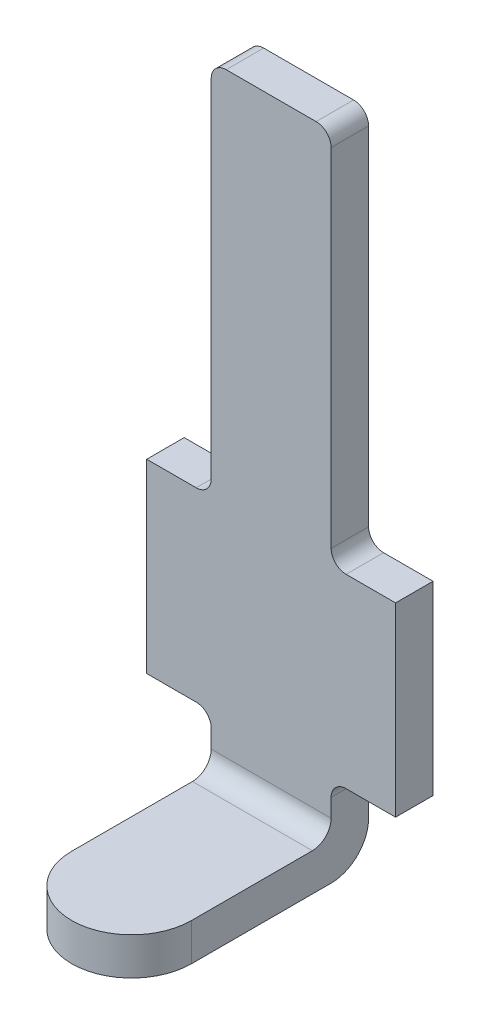
ISO-10303-21;
HEADER;
FILE_DESCRIPTION(('STEP AP214'),'2;1');
FILE_NAME('part.step','',(''),(''),'','','');
FILE_SCHEMA(('AUTOMOTIVE_DESIGN { 1 0 10303 214 1 1 1 1 }'));
ENDSEC;
DATA;
#1=APPLICATION_CONTEXT('core data for automotive mechanical design processes');
#2=APPLICATION_PROTOCOL_DEFINITION('international standard','automotive_design',2000,#1);
#3=PRODUCT_CONTEXT('',#1,'mechanical');
#4=PRODUCT('Part','Part','',(#3));
#5=PRODUCT_RELATED_PRODUCT_CATEGORY('part','',(#4));
#6=PRODUCT_DEFINITION_FORMATION('','',#4);
#7=PRODUCT_DEFINITION_CONTEXT('part definition',#1,'design');
#8=PRODUCT_DEFINITION('design','',#6,#7);
#9=PRODUCT_DEFINITION_SHAPE('','',#8);
#10=(LENGTH_UNIT() NAMED_UNIT(*) SI_UNIT(.MILLI.,.METRE.));
#11=(NAMED_UNIT(*) PLANE_ANGLE_UNIT() SI_UNIT($,.RADIAN.));
#12=(NAMED_UNIT(*) SI_UNIT($,.STERADIAN.) SOLID_ANGLE_UNIT());
#13=UNCERTAINTY_MEASURE_WITH_UNIT(LENGTH_MEASURE(1.E-05),#10,'distance_accuracy_value','');
#14=(GEOMETRIC_REPRESENTATION_CONTEXT(3) GLOBAL_UNCERTAINTY_ASSIGNED_CONTEXT((#13)) GLOBAL_UNIT_ASSIGNED_CONTEXT((#10,
#11,#12)) REPRESENTATION_CONTEXT('',''));
#15=CARTESIAN_POINT('',(0.,0.,0.));
#16=DIRECTION('',(0.,0.,1.));
#17=DIRECTION('',(1.,0.,0.));
#18=AXIS2_PLACEMENT_3D('',#15,#16,#17);
#19=CARTESIAN_POINT('',(-1.77,0.0459658151929143,0.749000000000012));
#20=DIRECTION('',(0.,0.,-1.));
#21=DIRECTION('',(-1.,0.,0.));
#22=AXIS2_PLACEMENT_3D('',#19,#20,#21);
#23=CYLINDRICAL_SURFACE('',#22,0.1);
#24=CARTESIAN_POINT('',(-1.77,0.0459658151929143,0.498999999999983));
#25=DIRECTION('',(0.,0.,1.));
#26=DIRECTION('',(1.,0.,0.));
#27=AXIS2_PLACEMENT_3D('',#24,#25,#26);
#28=CIRCLE('',#27,0.1);
#29=CARTESIAN_POINT('',(-1.67,0.0459658151929143,0.498999999999983));
#30=VERTEX_POINT('',#29);
#31=CARTESIAN_POINT('',(-1.77,0.145965815192914,0.499000000000012));
#32=VERTEX_POINT('',#31);
#33=EDGE_CURVE('E312',#30,#32,#28,.T.);
#34=ORIENTED_EDGE('',*,*,#33,.F.);
#35=DIRECTION('',(0.,0.,-1.));
#36=VECTOR('',#35,1.);
#37=CARTESIAN_POINT('',(-1.67,0.0459658151929143,0.499000000000012));
#38=LINE('',#37,#36);
#39=CARTESIAN_POINT('',(-1.67,0.0459658151929143,0.748999999999983));
#40=VERTEX_POINT('',#39);
#41=EDGE_CURVE('E331',#40,#30,#38,.T.);
#42=ORIENTED_EDGE('',*,*,#41,.F.);
#43=CARTESIAN_POINT('',(-1.77,0.0459658151929143,0.748999999999983));
#44=DIRECTION('',(0.,0.,-1.));
#45=DIRECTION('',(-1.,0.,0.));
#46=AXIS2_PLACEMENT_3D('',#43,#44,#45);
#47=CIRCLE('',#46,0.1);
#48=CARTESIAN_POINT('',(-1.77,0.145965815192914,0.749000000000012));
#49=VERTEX_POINT('',#48);
#50=EDGE_CURVE('E317',#49,#40,#47,.T.);
#51=ORIENTED_EDGE('',*,*,#50,.F.);
#52=DIRECTION('',(0.,0.,1.));
#53=VECTOR('',#52,1.);
#54=CARTESIAN_POINT('',(-1.77,0.145965815192914,0.748999999999983));
#55=LINE('',#54,#53);
#56=EDGE_CURVE('E411',#32,#49,#55,.T.);
#57=ORIENTED_EDGE('',*,*,#56,.F.);
#58=EDGE_LOOP('',(#34,#42,#51,#57));
#59=FACE_BOUND('',#58,.T.);
#60=ADVANCED_FACE('F16',(#59),#23,.F.);
#61=CARTESIAN_POINT('',(-0.77,0.0459658151929143,0.748999999999984));
#62=DIRECTION('',(0.,0.,1.));
#63=DIRECTION('',(1.,0.,0.));
#64=AXIS2_PLACEMENT_3D('',#61,#62,#63);
#65=CYLINDRICAL_SURFACE('',#64,0.1);
#66=CARTESIAN_POINT('',(-0.77,0.0459658151929143,0.498999999999984));
#67=DIRECTION('',(0.,0.,1.));
#68=DIRECTION('',(1.,0.,0.));
#69=AXIS2_PLACEMENT_3D('',#66,#67,#68);
#70=CIRCLE('',#69,0.1);
#71=CARTESIAN_POINT('',(-0.77,0.145965815192914,0.499000000000013));
#72=VERTEX_POINT('',#71);
#73=CARTESIAN_POINT('',(-0.87,0.0459658151929143,0.498999999999984));
#74=VERTEX_POINT('',#73);
#75=EDGE_CURVE('E292',#72,#74,#70,.T.);
#76=ORIENTED_EDGE('',*,*,#75,.F.);
#77=DIRECTION('',(0.,0.,-1.));
#78=VECTOR('',#77,1.);
#79=CARTESIAN_POINT('',(-0.77,0.145965815192914,0.749000000000013));
#80=LINE('',#79,#78);
#81=CARTESIAN_POINT('',(-0.77,0.145965815192914,0.749000000000013));
#82=VERTEX_POINT('',#81);
#83=EDGE_CURVE('E27',#82,#72,#80,.T.);
#84=ORIENTED_EDGE('',*,*,#83,.F.);
#85=CARTESIAN_POINT('',(-0.77,0.0459658151929143,0.748999999999984));
#86=DIRECTION('',(0.,0.,-1.));
#87=DIRECTION('',(-1.,0.,0.));
#88=AXIS2_PLACEMENT_3D('',#85,#86,#87);
#89=CIRCLE('',#88,0.1);
#90=CARTESIAN_POINT('',(-0.87,0.0459658151929143,0.748999999999984));
#91=VERTEX_POINT('',#90);
#92=EDGE_CURVE('E265',#91,#82,#89,.T.);
#93=ORIENTED_EDGE('',*,*,#92,.F.);
#94=DIRECTION('',(0.,0.,1.));
#95=VECTOR('',#94,1.);
#96=CARTESIAN_POINT('',(-0.87,0.0459658151929143,0.748999999999984));
#97=LINE('',#96,#95);
#98=EDGE_CURVE('E191',#74,#91,#97,.T.);
#99=ORIENTED_EDGE('',*,*,#98,.F.);
#100=EDGE_LOOP('',(#76,#84,#93,#99));
#101=FACE_BOUND('',#100,.T.);
#102=ADVANCED_FACE('F533',(#101),#65,.F.);
#103=CARTESIAN_POINT('',(-1.77,1.48437551370885,0.748999999999983));
#104=DIRECTION('',(0.,0.,1.));
#105=DIRECTION('',(1.,0.,0.));
#106=AXIS2_PLACEMENT_3D('',#103,#104,#105);
#107=CYLINDRICAL_SURFACE('',#106,0.1);
#108=CARTESIAN_POINT('',(-1.77,1.48437551370885,0.498999999999983));
#109=DIRECTION('',(0.,0.,1.));
#110=DIRECTION('',(1.,0.,0.));
#111=AXIS2_PLACEMENT_3D('',#108,#109,#110);
#112=CIRCLE('',#111,0.1);
#113=CARTESIAN_POINT('',(-1.77,1.38437551370885,0.499000000000012));
#114=VERTEX_POINT('',#113);
#115=CARTESIAN_POINT('',(-1.67,1.48437551370885,0.498999999999983));
#116=VERTEX_POINT('',#115);
#117=EDGE_CURVE('E79',#114,#116,#112,.T.);
#118=ORIENTED_EDGE('',*,*,#117,.F.);
#119=DIRECTION('',(0.,0.,-1.));
#120=VECTOR('',#119,1.);
#121=CARTESIAN_POINT('',(-1.77,1.38437551370885,0.749000000000012));
#122=LINE('',#121,#120);
#123=CARTESIAN_POINT('',(-1.77,1.38437551370885,0.749000000000012));
#124=VERTEX_POINT('',#123);
#125=EDGE_CURVE('E42',#124,#114,#122,.T.);
#126=ORIENTED_EDGE('',*,*,#125,.F.);
#127=CARTESIAN_POINT('',(-1.77,1.48437551370885,0.748999999999983));
#128=DIRECTION('',(0.,0.,-1.));
#129=DIRECTION('',(-1.,0.,0.));
#130=AXIS2_PLACEMENT_3D('',#127,#128,#129);
#131=CIRCLE('',#130,0.1);
#132=CARTESIAN_POINT('',(-1.67,1.48437551370885,0.748999999999983));
#133=VERTEX_POINT('',#132);
#134=EDGE_CURVE('E289',#133,#124,#131,.T.);
#135=ORIENTED_EDGE('',*,*,#134,.F.);
#136=DIRECTION('',(0.,0.,1.));
#137=VECTOR('',#136,1.);
#138=CARTESIAN_POINT('',(-1.67,1.48437551370885,0.748999999999983));
#139=LINE('',#138,#137);
#140=EDGE_CURVE('E321',#116,#133,#139,.T.);
#141=ORIENTED_EDGE('',*,*,#140,.F.);
#142=EDGE_LOOP('',(#118,#126,#135,#141));
#143=FACE_BOUND('',#142,.T.);
#144=ADVANCED_FACE('F535',(#143),#107,.F.);
#145=CARTESIAN_POINT('',(-0.77,1.48437551370885,0.749000000000014));
#146=DIRECTION('',(0.,0.,-1.));
#147=DIRECTION('',(-1.,0.,0.));
#148=AXIS2_PLACEMENT_3D('',#145,#146,#147);
#149=CYLINDRICAL_SURFACE('',#148,0.1);
#150=CARTESIAN_POINT('',(-0.77,1.48437551370885,0.498999999999985));
#151=DIRECTION('',(0.,0.,1.));
#152=DIRECTION('',(1.,0.,0.));
#153=AXIS2_PLACEMENT_3D('',#150,#151,#152);
#154=CIRCLE('',#153,0.1);
#155=CARTESIAN_POINT('',(-0.87,1.48437551370885,0.498999999999984));
#156=VERTEX_POINT('',#155);
#157=CARTESIAN_POINT('',(-0.77,1.38437551370885,0.499000000000013));
#158=VERTEX_POINT('',#157);
#159=EDGE_CURVE('E390',#156,#158,#154,.T.);
#160=ORIENTED_EDGE('',*,*,#159,.F.);
#161=DIRECTION('',(0.,0.,-1.));
#162=VECTOR('',#161,1.);
#163=CARTESIAN_POINT('',(-0.87,1.48437551370885,0.498999999999984));
#164=LINE('',#163,#162);
#165=CARTESIAN_POINT('',(-0.87,1.48437551370885,0.748999999999984));
#166=VERTEX_POINT('',#165);
#167=EDGE_CURVE('E20',#166,#156,#164,.T.);
#168=ORIENTED_EDGE('',*,*,#167,.F.);
#169=CARTESIAN_POINT('',(-0.77,1.48437551370885,0.748999999999984));
#170=DIRECTION('',(0.,0.,-1.));
#171=DIRECTION('',(-1.,0.,0.));
#172=AXIS2_PLACEMENT_3D('',#169,#170,#171);
#173=CIRCLE('',#172,0.1);
#174=CARTESIAN_POINT('',(-0.77,1.38437551370885,0.749000000000014));
#175=VERTEX_POINT('',#174);
#176=EDGE_CURVE('E337',#175,#166,#173,.T.);
#177=ORIENTED_EDGE('',*,*,#176,.F.);
#178=DIRECTION('',(0.,0.,1.));
#179=VECTOR('',#178,1.);
#180=CARTESIAN_POINT('',(-0.77,1.38437551370885,0.748999999999984));
#181=LINE('',#180,#179);
#182=EDGE_CURVE('E280',#158,#175,#181,.T.);
#183=ORIENTED_EDGE('',*,*,#182,.F.);
#184=EDGE_LOOP('',(#160,#168,#177,#183));
#185=FACE_BOUND('',#184,.T.);
#186=ADVANCED_FACE('F458',(#185),#149,.F.);
#187=CARTESIAN_POINT('',(-1.57,3.8,0.748999999999983));
#188=DIRECTION('',(0.,0.,-1.));
#189=DIRECTION('',(-1.,0.,0.));
#190=AXIS2_PLACEMENT_3D('',#187,#188,#189);
#191=CYLINDRICAL_SURFACE('',#190,0.1);
#192=CARTESIAN_POINT('',(-1.57,3.8,0.498999999999984));
#193=DIRECTION('',(0.,0.,-1.));
#194=DIRECTION('',(1.,0.,0.));
#195=AXIS2_PLACEMENT_3D('',#192,#193,#194);
#196=CIRCLE('',#195,0.1);
#197=CARTESIAN_POINT('',(-1.67,3.8,0.498999999999984));
#198=VERTEX_POINT('',#197);
#199=CARTESIAN_POINT('',(-1.57,3.9,0.498999999999984));
#200=VERTEX_POINT('',#199);
#201=EDGE_CURVE('E299',#198,#200,#196,.T.);
#202=ORIENTED_EDGE('',*,*,#201,.F.);
#203=DIRECTION('',(0.,0.,-1.));
#204=VECTOR('',#203,1.);
#205=CARTESIAN_POINT('',(-1.67,3.8,0.498999999999984));
#206=LINE('',#205,#204);
#207=CARTESIAN_POINT('',(-1.67,3.8,0.748999999999983));
#208=VERTEX_POINT('',#207);
#209=EDGE_CURVE('E285',#208,#198,#206,.T.);
#210=ORIENTED_EDGE('',*,*,#209,.F.);
#211=CARTESIAN_POINT('',(-1.57,3.8,0.748999999999983));
#212=DIRECTION('',(0.,0.,1.));
#213=DIRECTION('',(-1.,0.,0.));
#214=AXIS2_PLACEMENT_3D('',#211,#212,#213);
#215=CIRCLE('',#214,0.1);
#216=CARTESIAN_POINT('',(-1.57,3.9,0.748999999999983));
#217=VERTEX_POINT('',#216);
#218=EDGE_CURVE('E286',#217,#208,#215,.T.);
#219=ORIENTED_EDGE('',*,*,#218,.F.);
#220=DIRECTION('',(0.,0.,1.));
#221=VECTOR('',#220,1.);
#222=CARTESIAN_POINT('',(-1.57,3.9,0.748999999999983));
#223=LINE('',#222,#221);
#224=EDGE_CURVE('E412',#200,#217,#223,.T.);
#225=ORIENTED_EDGE('',*,*,#224,.F.);
#226=EDGE_LOOP('',(#202,#210,#219,#225));
#227=FACE_BOUND('',#226,.T.);
#228=ADVANCED_FACE('F552',(#227),#191,.T.);
#229=CARTESIAN_POINT('',(-0.97,3.8,0.748999999999984));
#230=DIRECTION('',(0.,0.,1.));
#231=DIRECTION('',(1.,0.,0.));
#232=AXIS2_PLACEMENT_3D('',#229,#230,#231);
#233=CYLINDRICAL_SURFACE('',#232,0.1);
#234=CARTESIAN_POINT('',(-0.97,3.8,0.498999999999985));
#235=DIRECTION('',(0.,0.,-1.));
#236=DIRECTION('',(1.,0.,0.));
#237=AXIS2_PLACEMENT_3D('',#234,#235,#236);
#238=CIRCLE('',#237,0.1);
#239=CARTESIAN_POINT('',(-0.97,3.9,0.498999999999985));
#240=VERTEX_POINT('',#239);
#241=CARTESIAN_POINT('',(-0.87,3.8,0.498999999999985));
#242=VERTEX_POINT('',#241);
#243=EDGE_CURVE('E387',#240,#242,#238,.T.);
#244=ORIENTED_EDGE('',*,*,#243,.F.);
#245=DIRECTION('',(0.,0.,-1.));
#246=VECTOR('',#245,1.);
#247=CARTESIAN_POINT('',(-0.97,3.9,0.748999999999984));
#248=LINE('',#247,#246);
#249=CARTESIAN_POINT('',(-0.97,3.9,0.748999999999984));
#250=VERTEX_POINT('',#249);
#251=EDGE_CURVE('E301',#250,#240,#248,.T.);
#252=ORIENTED_EDGE('',*,*,#251,.F.);
#253=CARTESIAN_POINT('',(-0.97,3.8,0.748999999999984));
#254=DIRECTION('',(0.,0.,1.));
#255=DIRECTION('',(-1.,0.,0.));
#256=AXIS2_PLACEMENT_3D('',#253,#254,#255);
#257=CIRCLE('',#256,0.1);
#258=CARTESIAN_POINT('',(-0.87,3.8,0.748999999999984));
#259=VERTEX_POINT('',#258);
#260=EDGE_CURVE('E62',#259,#250,#257,.T.);
#261=ORIENTED_EDGE('',*,*,#260,.F.);
#262=DIRECTION('',(0.,0.,1.));
#263=VECTOR('',#262,1.);
#264=CARTESIAN_POINT('',(-0.87,3.8,0.748999999999984));
#265=LINE('',#264,#263);
#266=EDGE_CURVE('E373',#242,#259,#265,.T.);
#267=ORIENTED_EDGE('',*,*,#266,.F.);
#268=EDGE_LOOP('',(#244,#252,#261,#267));
#269=FACE_BOUND('',#268,.T.);
#270=ADVANCED_FACE('F561',(#269),#233,.T.);
#271=CARTESIAN_POINT('',(-0.44,0.,1.00308650274883E-13));
#272=DIRECTION('',(-1.,0.,0.));
#273=DIRECTION('',(0.,0.,1.));
#274=AXIS2_PLACEMENT_3D('',#271,#272,#273);
#275=PLANE('',#274);
#276=DIRECTION('',(0.,0.,-1.));
#277=VECTOR('',#276,1.);
#278=CARTESIAN_POINT('',(-0.44,1.38437551370885,0.749000000000014));
#279=LINE('',#278,#277);
#280=CARTESIAN_POINT('',(-0.44,1.38437551370885,0.749000000000014));
#281=VERTEX_POINT('',#280);
#282=CARTESIAN_POINT('',(-0.44,1.38437551370885,0.499000000000014));
#283=VERTEX_POINT('',#282);
#284=EDGE_CURVE('E257',#281,#283,#279,.T.);
#285=ORIENTED_EDGE('',*,*,#284,.F.);
#286=DIRECTION('',(0.,-1.,0.));
#287=VECTOR('',#286,1.);
#288=CARTESIAN_POINT('',(-0.44,1.38437551370885,0.749000000000014));
#289=LINE('',#288,#287);
#290=CARTESIAN_POINT('',(-0.44,0.145965815192914,0.749000000000014));
#291=VERTEX_POINT('',#290);
#292=EDGE_CURVE('E255',#281,#291,#289,.T.);
#293=ORIENTED_EDGE('',*,*,#292,.T.);
#294=DIRECTION('',(0.,0.,-1.));
#295=VECTOR('',#294,1.);
#296=CARTESIAN_POINT('',(-0.44,0.145965815192914,0.749000000000014));
#297=LINE('',#296,#295);
#298=CARTESIAN_POINT('',(-0.44,0.145965815192914,0.499000000000014));
#299=VERTEX_POINT('',#298);
#300=EDGE_CURVE('E11',#291,#299,#297,.T.);
#301=ORIENTED_EDGE('',*,*,#300,.T.);
#302=DIRECTION('',(0.,-1.,0.));
#303=VECTOR('',#302,1.);
#304=CARTESIAN_POINT('',(-0.44,1.38437551370885,0.499000000000014));
#305=LINE('',#304,#303);
#306=EDGE_CURVE('E361',#283,#299,#305,.T.);
#307=ORIENTED_EDGE('',*,*,#306,.F.);
#308=EDGE_LOOP('',(#285,#293,#301,#307));
#309=FACE_BOUND('',#308,.T.);
#310=ADVANCED_FACE('F256',(#309),#275,.F.);
#311=CARTESIAN_POINT('',(-2.1,0.145965815192914,0.749000000000011));
#312=DIRECTION('',(0.,-1.,0.));
#313=DIRECTION('',(0.,0.,-1.));
#314=AXIS2_PLACEMENT_3D('',#311,#312,#313);
#315=PLANE('',#314);
#316=DIRECTION('',(1.,0.,0.));
#317=VECTOR('',#316,1.);
#318=CARTESIAN_POINT('',(-2.1,0.145965815192914,0.749000000000011));
#319=LINE('',#318,#317);
#320=EDGE_CURVE('E247',#82,#291,#319,.T.);
#321=ORIENTED_EDGE('',*,*,#320,.F.);
#322=ORIENTED_EDGE('',*,*,#83,.T.);
#323=DIRECTION('',(1.,0.,0.));
#324=VECTOR('',#323,1.);
#325=CARTESIAN_POINT('',(-2.1,0.145965815192914,0.499000000000011));
#326=LINE('',#325,#324);
#327=EDGE_CURVE('E250',#72,#299,#326,.T.);
#328=ORIENTED_EDGE('',*,*,#327,.T.);
#329=ORIENTED_EDGE('',*,*,#300,.F.);
#330=EDGE_LOOP('',(#321,#322,#328,#329));
#331=FACE_BOUND('',#330,.T.);
#332=ADVANCED_FACE('F245',(#331),#315,.T.);
#333=CARTESIAN_POINT('',(-2.1,1.38437551370885,0.749000000000012));
#334=DIRECTION('',(0.,-1.,0.));
#335=DIRECTION('',(0.,0.,-1.));
#336=AXIS2_PLACEMENT_3D('',#333,#334,#335);
#337=PLANE('',#336);
#338=DIRECTION('',(1.,0.,0.));
#339=VECTOR('',#338,1.);
#340=CARTESIAN_POINT('',(-2.1,1.38437551370885,0.499000000000011));
#341=LINE('',#340,#339);
#342=EDGE_CURVE('E399',#158,#283,#341,.T.);
#343=ORIENTED_EDGE('',*,*,#342,.F.);
#344=ORIENTED_EDGE('',*,*,#182,.T.);
#345=DIRECTION('',(1.,0.,0.));
#346=VECTOR('',#345,1.);
#347=CARTESIAN_POINT('',(-2.1,1.38437551370885,0.749000000000012));
#348=LINE('',#347,#346);
#349=EDGE_CURVE('E261',#175,#281,#348,.T.);
#350=ORIENTED_EDGE('',*,*,#349,.T.);
#351=ORIENTED_EDGE('',*,*,#284,.T.);
#352=EDGE_LOOP('',(#343,#344,#350,#351));
#353=FACE_BOUND('',#352,.T.);
#354=ADVANCED_FACE('F18',(#353),#337,.F.);
#355=CARTESIAN_POINT('',(-2.1,1.38437551370885,0.749000000000012));
#356=DIRECTION('',(0.,-1.,0.));
#357=DIRECTION('',(0.,0.,-1.));
#358=AXIS2_PLACEMENT_3D('',#355,#356,#357);
#359=PLANE('',#358);
#360=DIRECTION('',(1.,0.,0.));
#361=VECTOR('',#360,1.);
#362=CARTESIAN_POINT('',(-2.1,1.38437551370885,0.749000000000012));
#363=LINE('',#362,#361);
#364=CARTESIAN_POINT('',(-2.1,1.38437551370885,0.749000000000012));
#365=VERTEX_POINT('',#364);
#366=EDGE_CURVE('E338',#365,#124,#363,.T.);
#367=ORIENTED_EDGE('',*,*,#366,.T.);
#368=ORIENTED_EDGE('',*,*,#125,.T.);
#369=DIRECTION('',(1.,0.,0.));
#370=VECTOR('',#369,1.);
#371=CARTESIAN_POINT('',(-2.1,1.38437551370885,0.499000000000011));
#372=LINE('',#371,#370);
#373=CARTESIAN_POINT('',(-2.1,1.38437551370885,0.499000000000011));
#374=VERTEX_POINT('',#373);
#375=EDGE_CURVE('E300',#374,#114,#372,.T.);
#376=ORIENTED_EDGE('',*,*,#375,.F.);
#377=DIRECTION('',(0.,0.,-1.));
#378=VECTOR('',#377,1.);
#379=CARTESIAN_POINT('',(-2.1,1.38437551370885,0.749000000000012));
#380=LINE('',#379,#378);
#381=EDGE_CURVE('E341',#365,#374,#380,.T.);
#382=ORIENTED_EDGE('',*,*,#381,.F.);
#383=EDGE_LOOP('',(#367,#368,#376,#382));
#384=FACE_BOUND('',#383,.T.);
#385=ADVANCED_FACE('F555',(#384),#359,.F.);
#386=CARTESIAN_POINT('',(-2.1,0.145965815192914,0.749000000000011));
#387=DIRECTION('',(0.,-1.,0.));
#388=DIRECTION('',(0.,0.,-1.));
#389=AXIS2_PLACEMENT_3D('',#386,#387,#388);
#390=PLANE('',#389);
#391=DIRECTION('',(1.,0.,0.));
#392=VECTOR('',#391,1.);
#393=CARTESIAN_POINT('',(-2.1,0.145965815192914,0.499000000000011));
#394=LINE('',#393,#392);
#395=CARTESIAN_POINT('',(-2.1,0.145965815192914,0.499000000000011));
#396=VERTEX_POINT('',#395);
#397=EDGE_CURVE('E307',#396,#32,#394,.T.);
#398=ORIENTED_EDGE('',*,*,#397,.T.);
#399=ORIENTED_EDGE('',*,*,#56,.T.);
#400=DIRECTION('',(1.,0.,0.));
#401=VECTOR('',#400,1.);
#402=CARTESIAN_POINT('',(-2.1,0.145965815192914,0.749000000000011));
#403=LINE('',#402,#401);
#404=CARTESIAN_POINT('',(-2.1,0.145965815192914,0.749000000000011));
#405=VERTEX_POINT('',#404);
#406=EDGE_CURVE('E313',#405,#49,#403,.T.);
#407=ORIENTED_EDGE('',*,*,#406,.F.);
#408=DIRECTION('',(0.,0.,-1.));
#409=VECTOR('',#408,1.);
#410=CARTESIAN_POINT('',(-2.1,0.145965815192914,0.749000000000011));
#411=LINE('',#410,#409);
#412=EDGE_CURVE('E344',#405,#396,#411,.T.);
#413=ORIENTED_EDGE('',*,*,#412,.T.);
#414=EDGE_LOOP('',(#398,#399,#407,#413));
#415=FACE_BOUND('',#414,.T.);
#416=ADVANCED_FACE('F558',(#415),#390,.T.);
#417=CARTESIAN_POINT('',(-2.1,0.,0.));
#418=DIRECTION('',(-1.,0.,0.));
#419=DIRECTION('',(0.,0.,1.));
#420=AXIS2_PLACEMENT_3D('',#417,#418,#419);
#421=PLANE('',#420);
#422=ORIENTED_EDGE('',*,*,#381,.T.);
#423=DIRECTION('',(0.,-1.,0.));
#424=VECTOR('',#423,1.);
#425=CARTESIAN_POINT('',(-2.1,1.38437551370885,0.499000000000011));
#426=LINE('',#425,#424);
#427=EDGE_CURVE('E311',#374,#396,#426,.T.);
#428=ORIENTED_EDGE('',*,*,#427,.T.);
#429=ORIENTED_EDGE('',*,*,#412,.F.);
#430=DIRECTION('',(0.,-1.,0.));
#431=VECTOR('',#430,1.);
#432=CARTESIAN_POINT('',(-2.1,1.38437551370885,0.749000000000012));
#433=LINE('',#432,#431);
#434=EDGE_CURVE('E318',#365,#405,#433,.T.);
#435=ORIENTED_EDGE('',*,*,#434,.F.);
#436=EDGE_LOOP('',(#422,#428,#429,#435));
#437=FACE_BOUND('',#436,.T.);
#438=ADVANCED_FACE('F566',(#437),#421,.T.);
#439=CARTESIAN_POINT('',(-1.27,-0.2,1.68));
#440=DIRECTION('',(0.,-1.,0.));
#441=DIRECTION('',(0.,0.,-1.));
#442=AXIS2_PLACEMENT_3D('',#439,#440,#441);
#443=CYLINDRICAL_SURFACE('',#442,0.4);
#444=DIRECTION('',(0.,-1.,0.));
#445=VECTOR('',#444,1.);
#446=CARTESIAN_POINT('',(-0.87,-0.2,1.68));
#447=LINE('',#446,#445);
#448=CARTESIAN_POINT('',(-0.87,-0.2,1.68));
#449=VERTEX_POINT('',#448);
#450=CARTESIAN_POINT('',(-0.87,-0.45,1.68));
#451=VERTEX_POINT('',#450);
#452=EDGE_CURVE('E328',#449,#451,#447,.T.);
#453=ORIENTED_EDGE('',*,*,#452,.F.);
#454=CARTESIAN_POINT('',(-1.27,-0.2,1.68));
#455=DIRECTION('',(0.,1.,0.));
#456=DIRECTION('',(0.,0.,-1.));
#457=AXIS2_PLACEMENT_3D('',#454,#455,#456);
#458=CIRCLE('',#457,0.4);
#459=CARTESIAN_POINT('',(-1.67,-0.2,1.68));
#460=VERTEX_POINT('',#459);
#461=EDGE_CURVE('E326',#460,#449,#458,.T.);
#462=ORIENTED_EDGE('',*,*,#461,.F.);
#463=DIRECTION('',(0.,1.,0.));
#464=VECTOR('',#463,1.);
#465=CARTESIAN_POINT('',(-1.67,-0.2,1.68));
#466=LINE('',#465,#464);
#467=CARTESIAN_POINT('',(-1.67,-0.45,1.68));
#468=VERTEX_POINT('',#467);
#469=EDGE_CURVE('E345',#468,#460,#466,.T.);
#470=ORIENTED_EDGE('',*,*,#469,.F.);
#471=CARTESIAN_POINT('',(-1.27,-0.45,1.68));
#472=DIRECTION('',(0.,-1.,0.));
#473=DIRECTION('',(0.,0.,1.));
#474=AXIS2_PLACEMENT_3D('',#471,#472,#473);
#475=CIRCLE('',#474,0.4);
#476=EDGE_CURVE('E346',#451,#468,#475,.T.);
#477=ORIENTED_EDGE('',*,*,#476,.F.);
#478=EDGE_LOOP('',(#453,#462,#470,#477));
#479=FACE_BOUND('',#478,.T.);
#480=ADVANCED_FACE('F510',(#479),#443,.T.);
#481=CARTESIAN_POINT('',(-1.67,-0.2,0.748999999999983));
#482=DIRECTION('',(-1.,0.,0.));
#483=DIRECTION('',(0.,0.,1.));
#484=AXIS2_PLACEMENT_3D('',#481,#482,#483);
#485=PLANE('',#484);
#486=DIRECTION('',(0.,-1.,0.));
#487=VECTOR('',#486,1.);
#488=CARTESIAN_POINT('',(-1.67,3.9,0.748999999999983));
#489=LINE('',#488,#487);
#490=CARTESIAN_POINT('',(-1.67,-0.0749999999999988,0.748999999999983));
#491=VERTEX_POINT('',#490);
#492=EDGE_CURVE('E395',#40,#491,#489,.T.);
#493=ORIENTED_EDGE('',*,*,#492,.F.);
#494=ORIENTED_EDGE('',*,*,#41,.T.);
#495=DIRECTION('',(0.,1.,0.));
#496=VECTOR('',#495,1.);
#497=CARTESIAN_POINT('',(-1.67,3.9,0.498999999999984));
#498=LINE('',#497,#496);
#499=CARTESIAN_POINT('',(-1.67,-0.2,0.498999999999983));
#500=VERTEX_POINT('',#499);
#501=EDGE_CURVE('E382',#500,#30,#498,.T.);
#502=ORIENTED_EDGE('',*,*,#501,.F.);
#503=CARTESIAN_POINT('',(-1.67,-0.2,0.748999999999983));
#504=DIRECTION('',(1.,0.,0.));
#505=DIRECTION('',(0.,0.,1.));
#506=AXIS2_PLACEMENT_3D('',#503,#504,#505);
#507=CIRCLE('',#506,0.25);
#508=CARTESIAN_POINT('',(-1.67,-0.45,0.748999999999983));
#509=VERTEX_POINT('',#508);
#510=EDGE_CURVE('E236',#509,#500,#507,.T.);
#511=ORIENTED_EDGE('',*,*,#510,.F.);
#512=DIRECTION('',(0.,0.,-1.));
#513=VECTOR('',#512,1.);
#514=CARTESIAN_POINT('',(-1.67,-0.45,0.748999999999983));
#515=LINE('',#514,#513);
#516=EDGE_CURVE('E350',#468,#509,#515,.T.);
#517=ORIENTED_EDGE('',*,*,#516,.F.);
#518=ORIENTED_EDGE('',*,*,#469,.T.);
#519=DIRECTION('',(0.,0.,1.));
#520=VECTOR('',#519,1.);
#521=CARTESIAN_POINT('',(-1.67,-0.2,0.873999999999983));
#522=LINE('',#521,#520);
#523=CARTESIAN_POINT('',(-1.67,-0.2,0.873999999999983));
#524=VERTEX_POINT('',#523);
#525=EDGE_CURVE('E322',#524,#460,#522,.T.);
#526=ORIENTED_EDGE('',*,*,#525,.F.);
#527=CARTESIAN_POINT('',(-1.67,-0.0749999999999988,0.873999999999983));
#528=DIRECTION('',(-1.,0.,0.));
#529=DIRECTION('',(0.,0.,1.));
#530=AXIS2_PLACEMENT_3D('',#527,#528,#529);
#531=CIRCLE('',#530,0.125);
#532=EDGE_CURVE('E332',#491,#524,#531,.T.);
#533=ORIENTED_EDGE('',*,*,#532,.F.);
#534=EDGE_LOOP('',(#493,#494,#502,#511,#517,#518,#526,#533));
#535=FACE_BOUND('',#534,.T.);
#536=ADVANCED_FACE('F502',(#535),#485,.T.);
#537=CARTESIAN_POINT('',(-0.87,-0.2,0.748999999999984));
#538=DIRECTION('',(-1.,0.,0.));
#539=DIRECTION('',(0.,0.,1.));
#540=AXIS2_PLACEMENT_3D('',#537,#538,#539);
#541=PLANE('',#540);
#542=DIRECTION('',(0.,1.,0.));
#543=VECTOR('',#542,1.);
#544=CARTESIAN_POINT('',(-0.87,3.9,0.498999999999985));
#545=LINE('',#544,#543);
#546=CARTESIAN_POINT('',(-0.87,-0.2,0.498999999999984));
#547=VERTEX_POINT('',#546);
#548=EDGE_CURVE('E296',#547,#74,#545,.T.);
#549=ORIENTED_EDGE('',*,*,#548,.T.);
#550=ORIENTED_EDGE('',*,*,#98,.T.);
#551=DIRECTION('',(0.,-1.,0.));
#552=VECTOR('',#551,1.);
#553=CARTESIAN_POINT('',(-0.87,3.9,0.748999999999984));
#554=LINE('',#553,#552);
#555=CARTESIAN_POINT('',(-0.87,-0.0749999999999988,0.748999999999984));
#556=VERTEX_POINT('',#555);
#557=EDGE_CURVE('E273',#91,#556,#554,.T.);
#558=ORIENTED_EDGE('',*,*,#557,.T.);
#559=CARTESIAN_POINT('',(-0.87,-0.0749999999999988,0.873999999999984));
#560=DIRECTION('',(-1.,0.,0.));
#561=DIRECTION('',(0.,0.,1.));
#562=AXIS2_PLACEMENT_3D('',#559,#560,#561);
#563=CIRCLE('',#562,0.125);
#564=CARTESIAN_POINT('',(-0.87,-0.2,0.873999999999984));
#565=VERTEX_POINT('',#564);
#566=EDGE_CURVE('E327',#556,#565,#563,.T.);
#567=ORIENTED_EDGE('',*,*,#566,.T.);
#568=DIRECTION('',(0.,0.,1.));
#569=VECTOR('',#568,1.);
#570=CARTESIAN_POINT('',(-0.87,-0.2,0.873999999999984));
#571=LINE('',#570,#569);
#572=EDGE_CURVE('E351',#565,#449,#571,.T.);
#573=ORIENTED_EDGE('',*,*,#572,.T.);
#574=ORIENTED_EDGE('',*,*,#452,.T.);
#575=DIRECTION('',(0.,0.,-1.));
#576=VECTOR('',#575,1.);
#577=CARTESIAN_POINT('',(-0.87,-0.45,0.748999999999984));
#578=LINE('',#577,#576);
#579=CARTESIAN_POINT('',(-0.87,-0.45,0.748999999999984));
#580=VERTEX_POINT('',#579);
#581=EDGE_CURVE('E403',#451,#580,#578,.T.);
#582=ORIENTED_EDGE('',*,*,#581,.T.);
#583=CARTESIAN_POINT('',(-0.87,-0.2,0.748999999999984));
#584=DIRECTION('',(1.,0.,0.));
#585=DIRECTION('',(0.,0.,1.));
#586=AXIS2_PLACEMENT_3D('',#583,#584,#585);
#587=CIRCLE('',#586,0.25);
#588=EDGE_CURVE('E225',#580,#547,#587,.T.);
#589=ORIENTED_EDGE('',*,*,#588,.T.);
#590=EDGE_LOOP('',(#549,#550,#558,#567,#573,#574,#582,#589));
#591=FACE_BOUND('',#590,.T.);
#592=ADVANCED_FACE('F512',(#591),#541,.F.);
#593=CARTESIAN_POINT('',(-0.87,3.9,0.498999999999985));
#594=DIRECTION('',(0.,0.,1.));
#595=DIRECTION('',(1.,0.,0.));
#596=AXIS2_PLACEMENT_3D('',#593,#594,#595);
#597=PLANE('',#596);
#598=DIRECTION('',(-1.,0.,0.));
#599=VECTOR('',#598,1.);
#600=CARTESIAN_POINT('',(-0.87,3.9,0.498999999999985));
#601=LINE('',#600,#599);
#602=EDGE_CURVE('E305',#240,#200,#601,.T.);
#603=ORIENTED_EDGE('',*,*,#602,.F.);
#604=ORIENTED_EDGE('',*,*,#243,.T.);
#605=DIRECTION('',(0.,1.,0.));
#606=VECTOR('',#605,1.);
#607=CARTESIAN_POINT('',(-0.87,3.9,0.498999999999985));
#608=LINE('',#607,#606);
#609=EDGE_CURVE('E378',#156,#242,#608,.T.);
#610=ORIENTED_EDGE('',*,*,#609,.F.);
#611=ORIENTED_EDGE('',*,*,#159,.T.);
#612=ORIENTED_EDGE('',*,*,#342,.T.);
#613=ORIENTED_EDGE('',*,*,#306,.T.);
#614=ORIENTED_EDGE('',*,*,#327,.F.);
#615=ORIENTED_EDGE('',*,*,#75,.T.);
#616=ORIENTED_EDGE('',*,*,#548,.F.);
#617=DIRECTION('',(-1.,0.,0.));
#618=VECTOR('',#617,1.);
#619=CARTESIAN_POINT('',(-0.87,-0.2,0.498999999999984));
#620=LINE('',#619,#618);
#621=EDGE_CURVE('E482',#547,#500,#620,.T.);
#622=ORIENTED_EDGE('',*,*,#621,.T.);
#623=ORIENTED_EDGE('',*,*,#501,.T.);
#624=ORIENTED_EDGE('',*,*,#33,.T.);
#625=ORIENTED_EDGE('',*,*,#397,.F.);
#626=ORIENTED_EDGE('',*,*,#427,.F.);
#627=ORIENTED_EDGE('',*,*,#375,.T.);
#628=ORIENTED_EDGE('',*,*,#117,.T.);
#629=DIRECTION('',(0.,1.,0.));
#630=VECTOR('',#629,1.);
#631=CARTESIAN_POINT('',(-1.67,3.9,0.498999999999984));
#632=LINE('',#631,#630);
#633=EDGE_CURVE('E355',#116,#198,#632,.T.);
#634=ORIENTED_EDGE('',*,*,#633,.T.);
#635=ORIENTED_EDGE('',*,*,#201,.T.);
#636=EDGE_LOOP('',(#603,#604,#610,#611,#612,#613,#614,#615,#616,#622,#623,#624,#625,#626,#627,
#628,#634,#635));
#637=FACE_BOUND('',#636,.T.);
#638=ADVANCED_FACE('F532',(#637),#597,.F.);
#639=CARTESIAN_POINT('',(-0.87,-0.2,0.748999999999984));
#640=DIRECTION('',(-1.,0.,0.));
#641=DIRECTION('',(0.,0.,1.));
#642=AXIS2_PLACEMENT_3D('',#639,#640,#641);
#643=CYLINDRICAL_SURFACE('',#642,0.25);
#644=ORIENTED_EDGE('',*,*,#510,.T.);
#645=ORIENTED_EDGE('',*,*,#621,.F.);
#646=ORIENTED_EDGE('',*,*,#588,.F.);
#647=DIRECTION('',(-1.,0.,0.));
#648=VECTOR('',#647,1.);
#649=CARTESIAN_POINT('',(-0.87,-0.45,0.748999999999984));
#650=LINE('',#649,#648);
#651=EDGE_CURVE('E406',#580,#509,#650,.T.);
#652=ORIENTED_EDGE('',*,*,#651,.T.);
#653=EDGE_LOOP('',(#644,#645,#646,#652));
#654=FACE_BOUND('',#653,.T.);
#655=ADVANCED_FACE('F525',(#654),#643,.T.);
#656=CARTESIAN_POINT('',(-0.87,-0.45,0.748999999999984));
#657=DIRECTION('',(0.,1.,0.));
#658=DIRECTION('',(0.,0.,-1.));
#659=AXIS2_PLACEMENT_3D('',#656,#657,#658);
#660=PLANE('',#659);
#661=ORIENTED_EDGE('',*,*,#476,.T.);
#662=ORIENTED_EDGE('',*,*,#516,.T.);
#663=ORIENTED_EDGE('',*,*,#651,.F.);
#664=ORIENTED_EDGE('',*,*,#581,.F.);
#665=EDGE_LOOP('',(#661,#662,#663,#664));
#666=FACE_BOUND('',#665,.T.);
#667=ADVANCED_FACE('F528',(#666),#660,.F.);
#668=CARTESIAN_POINT('',(-0.87,-0.2,0.873999999999984));
#669=DIRECTION('',(0.,-1.,0.));
#670=DIRECTION('',(0.,0.,-1.));
#671=AXIS2_PLACEMENT_3D('',#668,#669,#670);
#672=PLANE('',#671);
#673=ORIENTED_EDGE('',*,*,#525,.T.);
#674=ORIENTED_EDGE('',*,*,#461,.T.);
#675=ORIENTED_EDGE('',*,*,#572,.F.);
#676=DIRECTION('',(-1.,0.,0.));
#677=VECTOR('',#676,1.);
#678=CARTESIAN_POINT('',(-0.87,-0.2,0.873999999999984));
#679=LINE('',#678,#677);
#680=EDGE_CURVE('E336',#565,#524,#679,.T.);
#681=ORIENTED_EDGE('',*,*,#680,.T.);
#682=EDGE_LOOP('',(#673,#674,#675,#681));
#683=FACE_BOUND('',#682,.T.);
#684=ADVANCED_FACE('F494',(#683),#672,.F.);
#685=CARTESIAN_POINT('',(-0.87,-0.0749999999999988,0.873999999999984));
#686=DIRECTION('',(-1.,0.,0.));
#687=DIRECTION('',(0.,0.,1.));
#688=AXIS2_PLACEMENT_3D('',#685,#686,#687);
#689=CYLINDRICAL_SURFACE('',#688,0.125);
#690=ORIENTED_EDGE('',*,*,#532,.T.);
#691=ORIENTED_EDGE('',*,*,#680,.F.);
#692=ORIENTED_EDGE('',*,*,#566,.F.);
#693=DIRECTION('',(-1.,0.,0.));
#694=VECTOR('',#693,1.);
#695=CARTESIAN_POINT('',(-0.87,-0.0749999999999988,0.748999999999984));
#696=LINE('',#695,#694);
#697=EDGE_CURVE('E391',#556,#491,#696,.T.);
#698=ORIENTED_EDGE('',*,*,#697,.T.);
#699=EDGE_LOOP('',(#690,#691,#692,#698));
#700=FACE_BOUND('',#699,.T.);
#701=ADVANCED_FACE('F498',(#700),#689,.F.);
#702=CARTESIAN_POINT('',(-0.87,3.9,0.748999999999984));
#703=DIRECTION('',(0.,0.,-1.));
#704=DIRECTION('',(0.,-1.,0.));
#705=AXIS2_PLACEMENT_3D('',#702,#703,#704);
#706=PLANE('',#705);
#707=DIRECTION('',(0.,-1.,0.));
#708=VECTOR('',#707,1.);
#709=CARTESIAN_POINT('',(-0.87,3.9,0.748999999999984));
#710=LINE('',#709,#708);
#711=EDGE_CURVE('E377',#259,#166,#710,.T.);
#712=ORIENTED_EDGE('',*,*,#711,.F.);
#713=ORIENTED_EDGE('',*,*,#260,.T.);
#714=DIRECTION('',(-1.,0.,0.));
#715=VECTOR('',#714,1.);
#716=CARTESIAN_POINT('',(-0.87,3.9,0.748999999999984));
#717=LINE('',#716,#715);
#718=EDGE_CURVE('E306',#250,#217,#717,.T.);
#719=ORIENTED_EDGE('',*,*,#718,.T.);
#720=ORIENTED_EDGE('',*,*,#218,.T.);
#721=DIRECTION('',(0.,-1.,0.));
#722=VECTOR('',#721,1.);
#723=CARTESIAN_POINT('',(-1.67,3.9,0.748999999999983));
#724=LINE('',#723,#722);
#725=EDGE_CURVE('E281',#208,#133,#724,.T.);
#726=ORIENTED_EDGE('',*,*,#725,.T.);
#727=ORIENTED_EDGE('',*,*,#134,.T.);
#728=ORIENTED_EDGE('',*,*,#366,.F.);
#729=ORIENTED_EDGE('',*,*,#434,.T.);
#730=ORIENTED_EDGE('',*,*,#406,.T.);
#731=ORIENTED_EDGE('',*,*,#50,.T.);
#732=ORIENTED_EDGE('',*,*,#492,.T.);
#733=ORIENTED_EDGE('',*,*,#697,.F.);
#734=ORIENTED_EDGE('',*,*,#557,.F.);
#735=ORIENTED_EDGE('',*,*,#92,.T.);
#736=ORIENTED_EDGE('',*,*,#320,.T.);
#737=ORIENTED_EDGE('',*,*,#292,.F.);
#738=ORIENTED_EDGE('',*,*,#349,.F.);
#739=ORIENTED_EDGE('',*,*,#176,.T.);
#740=EDGE_LOOP('',(#712,#713,#719,#720,#726,#727,#728,#729,#730,#731,#732,#733,#734,#735,#736,
#737,#738,#739));
#741=FACE_BOUND('',#740,.T.);
#742=ADVANCED_FACE('F263',(#741),#706,.F.);
#743=CARTESIAN_POINT('',(-0.87,3.9,0.748999999999984));
#744=DIRECTION('',(0.,-1.,0.));
#745=DIRECTION('',(0.,0.,-1.));
#746=AXIS2_PLACEMENT_3D('',#743,#744,#745);
#747=PLANE('',#746);
#748=ORIENTED_EDGE('',*,*,#718,.F.);
#749=ORIENTED_EDGE('',*,*,#251,.T.);
#750=ORIENTED_EDGE('',*,*,#602,.T.);
#751=ORIENTED_EDGE('',*,*,#224,.T.);
#752=EDGE_LOOP('',(#748,#749,#750,#751));
#753=FACE_BOUND('',#752,.T.);
#754=ADVANCED_FACE('F583',(#753),#747,.F.);
#755=CARTESIAN_POINT('',(-1.67,-0.2,0.748999999999983));
#756=DIRECTION('',(-1.,0.,0.));
#757=DIRECTION('',(0.,0.,1.));
#758=AXIS2_PLACEMENT_3D('',#755,#756,#757);
#759=PLANE('',#758);
#760=ORIENTED_EDGE('',*,*,#725,.F.);
#761=ORIENTED_EDGE('',*,*,#209,.T.);
#762=ORIENTED_EDGE('',*,*,#633,.F.);
#763=ORIENTED_EDGE('',*,*,#140,.T.);
#764=EDGE_LOOP('',(#760,#761,#762,#763));
#765=FACE_BOUND('',#764,.T.);
#766=ADVANCED_FACE('F582',(#765),#759,.T.);
#767=CARTESIAN_POINT('',(-0.87,-0.2,0.748999999999984));
#768=DIRECTION('',(-1.,0.,0.));
#769=DIRECTION('',(0.,0.,1.));
#770=AXIS2_PLACEMENT_3D('',#767,#768,#769);
#771=PLANE('',#770);
#772=ORIENTED_EDGE('',*,*,#609,.T.);
#773=ORIENTED_EDGE('',*,*,#266,.T.);
#774=ORIENTED_EDGE('',*,*,#711,.T.);
#775=ORIENTED_EDGE('',*,*,#167,.T.);
#776=EDGE_LOOP('',(#772,#773,#774,#775));
#777=FACE_BOUND('',#776,.T.);
#778=ADVANCED_FACE('F463',(#777),#771,.F.);
#779=CLOSED_SHELL('',(#60,#102,#144,#186,#228,#270,#310,#332,#354,#385,#416,#438,#480,#536,#592,
#638,#655,#667,#684,#701,#742,#754,#766,#778));
#780=MANIFOLD_SOLID_BREP('B1',#779);
#781=ADVANCED_BREP_SHAPE_REPRESENTATION('',(#18,#780),#14);
#782=SHAPE_DEFINITION_REPRESENTATION(#9,#781);
ENDSEC;
END-ISO-10303-21;
